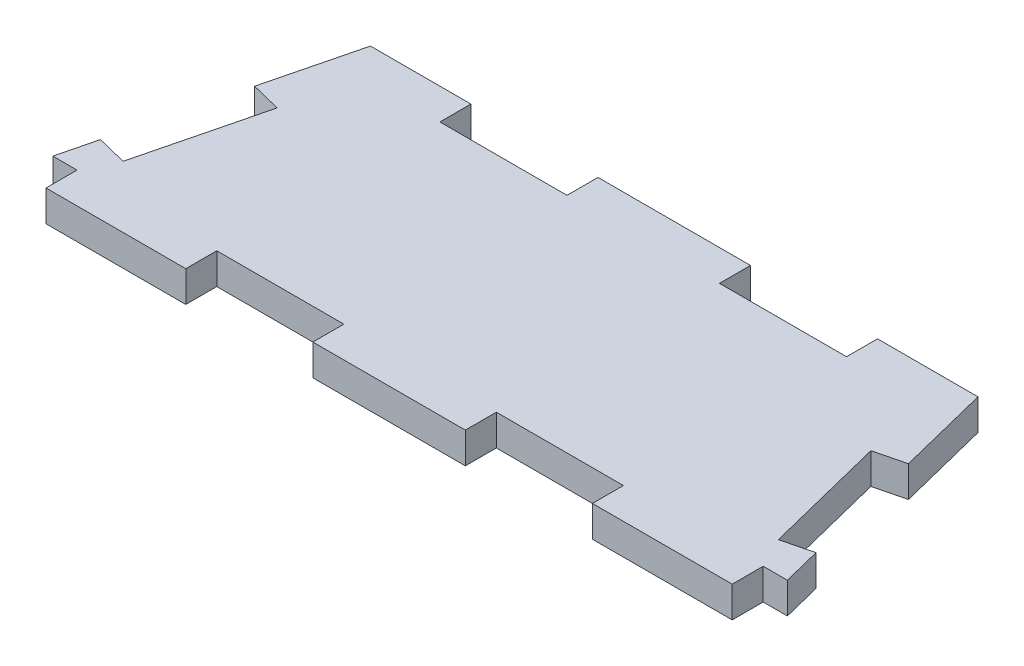
ISO-10303-21;
HEADER;
FILE_DESCRIPTION(('STEP AP214'),'2;1');
FILE_NAME('part.step','',(''),(''),'','','');
FILE_SCHEMA(('AUTOMOTIVE_DESIGN { 1 0 10303 214 1 1 1 1 }'));
ENDSEC;
DATA;
#1=APPLICATION_CONTEXT('core data for automotive mechanical design processes');
#2=APPLICATION_PROTOCOL_DEFINITION('international standard','automotive_design',2000,#1);
#3=PRODUCT_CONTEXT('',#1,'mechanical');
#4=PRODUCT('Part','Part','',(#3));
#5=PRODUCT_RELATED_PRODUCT_CATEGORY('part','',(#4));
#6=PRODUCT_DEFINITION_FORMATION('','',#4);
#7=PRODUCT_DEFINITION_CONTEXT('part definition',#1,'design');
#8=PRODUCT_DEFINITION('design','',#6,#7);
#9=PRODUCT_DEFINITION_SHAPE('','',#8);
#10=(LENGTH_UNIT() NAMED_UNIT(*) SI_UNIT(.MILLI.,.METRE.));
#11=(NAMED_UNIT(*) PLANE_ANGLE_UNIT() SI_UNIT($,.RADIAN.));
#12=(NAMED_UNIT(*) SI_UNIT($,.STERADIAN.) SOLID_ANGLE_UNIT());
#13=UNCERTAINTY_MEASURE_WITH_UNIT(LENGTH_MEASURE(1.E-05),#10,'distance_accuracy_value','');
#14=(GEOMETRIC_REPRESENTATION_CONTEXT(3) GLOBAL_UNCERTAINTY_ASSIGNED_CONTEXT((#13)) GLOBAL_UNIT_ASSIGNED_CONTEXT((#10,
#11,#12)) REPRESENTATION_CONTEXT('',''));
#15=CARTESIAN_POINT('',(0.,0.,0.));
#16=DIRECTION('',(0.,0.,1.));
#17=DIRECTION('',(1.,0.,0.));
#18=AXIS2_PLACEMENT_3D('',#15,#16,#17);
#19=CARTESIAN_POINT('',(-27.,2.44,0.));
#20=DIRECTION('',(1.,0.,0.));
#21=DIRECTION('',(0.,0.,-1.));
#22=AXIS2_PLACEMENT_3D('',#19,#20,#21);
#23=PLANE('',#22);
#24=DIRECTION('',(0.,0.,1.));
#25=VECTOR('',#24,1.);
#26=CARTESIAN_POINT('',(-27.,0.,0.));
#27=LINE('',#26,#25);
#28=CARTESIAN_POINT('',(-27.,0.,-2.44));
#29=VERTEX_POINT('',#28);
#30=CARTESIAN_POINT('',(-27.,0.,0.));
#31=VERTEX_POINT('',#30);
#32=EDGE_CURVE('E275',#29,#31,#27,.T.);
#33=ORIENTED_EDGE('',*,*,#32,.T.);
#34=DIRECTION('',(0.,-1.,0.));
#35=VECTOR('',#34,1.);
#36=CARTESIAN_POINT('',(-27.,2.44,0.));
#37=LINE('',#36,#35);
#38=CARTESIAN_POINT('',(-27.,2.44,0.));
#39=VERTEX_POINT('',#38);
#40=EDGE_CURVE('E11',#39,#31,#37,.T.);
#41=ORIENTED_EDGE('',*,*,#40,.F.);
#42=DIRECTION('',(0.,0.,1.));
#43=VECTOR('',#42,1.);
#44=CARTESIAN_POINT('',(-27.,2.44,0.));
#45=LINE('',#44,#43);
#46=CARTESIAN_POINT('',(-27.,2.44,-2.44));
#47=VERTEX_POINT('',#46);
#48=EDGE_CURVE('E337',#47,#39,#45,.T.);
#49=ORIENTED_EDGE('',*,*,#48,.F.);
#50=DIRECTION('',(0.,-1.,0.));
#51=VECTOR('',#50,1.);
#52=CARTESIAN_POINT('',(-27.,2.44,-2.44));
#53=LINE('',#52,#51);
#54=EDGE_CURVE('E271',#47,#29,#53,.T.);
#55=ORIENTED_EDGE('',*,*,#54,.T.);
#56=EDGE_LOOP('',(#33,#41,#49,#55));
#57=FACE_BOUND('',#56,.T.);
#58=ADVANCED_FACE('F35',(#57),#23,.F.);
#59=CARTESIAN_POINT('',(-27.,2.44,0.));
#60=DIRECTION('',(0.,0.,-1.));
#61=DIRECTION('',(-1.,0.,0.));
#62=AXIS2_PLACEMENT_3D('',#59,#60,#61);
#63=PLANE('',#62);
#64=DIRECTION('',(1.,0.,0.));
#65=VECTOR('',#64,1.);
#66=CARTESIAN_POINT('',(-27.,0.,0.));
#67=LINE('',#66,#65);
#68=CARTESIAN_POINT('',(-16.,0.,0.));
#69=VERTEX_POINT('',#68);
#70=EDGE_CURVE('E278',#31,#69,#67,.T.);
#71=ORIENTED_EDGE('',*,*,#70,.T.);
#72=DIRECTION('',(0.,-1.,0.));
#73=VECTOR('',#72,1.);
#74=CARTESIAN_POINT('',(-16.,2.44,0.));
#75=LINE('',#74,#73);
#76=CARTESIAN_POINT('',(-16.,2.44,0.));
#77=VERTEX_POINT('',#76);
#78=EDGE_CURVE('E43',#77,#69,#75,.T.);
#79=ORIENTED_EDGE('',*,*,#78,.F.);
#80=DIRECTION('',(1.,0.,0.));
#81=VECTOR('',#80,1.);
#82=CARTESIAN_POINT('',(-27.,2.44,0.));
#83=LINE('',#82,#81);
#84=EDGE_CURVE('E166',#39,#77,#83,.T.);
#85=ORIENTED_EDGE('',*,*,#84,.F.);
#86=ORIENTED_EDGE('',*,*,#40,.T.);
#87=EDGE_LOOP('',(#71,#79,#85,#86));
#88=FACE_BOUND('',#87,.T.);
#89=ADVANCED_FACE('F515',(#88),#63,.F.);
#90=CARTESIAN_POINT('',(-16.,2.44,0.));
#91=DIRECTION('',(-1.,0.,0.));
#92=DIRECTION('',(0.,0.,1.));
#93=AXIS2_PLACEMENT_3D('',#90,#91,#92);
#94=PLANE('',#93);
#95=DIRECTION('',(0.,0.,-1.));
#96=VECTOR('',#95,1.);
#97=CARTESIAN_POINT('',(-16.,0.,0.));
#98=LINE('',#97,#96);
#99=CARTESIAN_POINT('',(-16.,0.,-2.44));
#100=VERTEX_POINT('',#99);
#101=EDGE_CURVE('E280',#69,#100,#98,.T.);
#102=ORIENTED_EDGE('',*,*,#101,.T.);
#103=DIRECTION('',(0.,-1.,0.));
#104=VECTOR('',#103,1.);
#105=CARTESIAN_POINT('',(-16.,2.44,-2.44));
#106=LINE('',#105,#104);
#107=CARTESIAN_POINT('',(-16.,2.44,-2.44));
#108=VERTEX_POINT('',#107);
#109=EDGE_CURVE('E416',#108,#100,#106,.T.);
#110=ORIENTED_EDGE('',*,*,#109,.F.);
#111=DIRECTION('',(0.,0.,-1.));
#112=VECTOR('',#111,1.);
#113=CARTESIAN_POINT('',(-16.,2.44,0.));
#114=LINE('',#113,#112);
#115=EDGE_CURVE('E424',#77,#108,#114,.T.);
#116=ORIENTED_EDGE('',*,*,#115,.F.);
#117=ORIENTED_EDGE('',*,*,#78,.T.);
#118=EDGE_LOOP('',(#102,#110,#116,#117));
#119=FACE_BOUND('',#118,.T.);
#120=ADVANCED_FACE('F422',(#119),#94,.F.);
#121=CARTESIAN_POINT('',(-6.,2.44,-2.44));
#122=DIRECTION('',(0.,0.,-1.));
#123=DIRECTION('',(-1.,0.,0.));
#124=AXIS2_PLACEMENT_3D('',#121,#122,#123);
#125=PLANE('',#124);
#126=DIRECTION('',(1.,0.,0.));
#127=VECTOR('',#126,1.);
#128=CARTESIAN_POINT('',(-6.,0.,-2.44));
#129=LINE('',#128,#127);
#130=CARTESIAN_POINT('',(-6.,0.,-2.44));
#131=VERTEX_POINT('',#130);
#132=EDGE_CURVE('E282',#100,#131,#129,.T.);
#133=ORIENTED_EDGE('',*,*,#132,.T.);
#134=DIRECTION('',(0.,-1.,0.));
#135=VECTOR('',#134,1.);
#136=CARTESIAN_POINT('',(-6.,2.44,-2.44));
#137=LINE('',#136,#135);
#138=CARTESIAN_POINT('',(-6.,2.44,-2.44));
#139=VERTEX_POINT('',#138);
#140=EDGE_CURVE('E413',#139,#131,#137,.T.);
#141=ORIENTED_EDGE('',*,*,#140,.F.);
#142=DIRECTION('',(1.,0.,0.));
#143=VECTOR('',#142,1.);
#144=CARTESIAN_POINT('',(-6.,2.44,-2.44));
#145=LINE('',#144,#143);
#146=EDGE_CURVE('E442',#108,#139,#145,.T.);
#147=ORIENTED_EDGE('',*,*,#146,.F.);
#148=ORIENTED_EDGE('',*,*,#109,.T.);
#149=EDGE_LOOP('',(#133,#141,#147,#148));
#150=FACE_BOUND('',#149,.T.);
#151=ADVANCED_FACE('F433',(#150),#125,.F.);
#152=CARTESIAN_POINT('',(-6.,2.44,0.));
#153=DIRECTION('',(1.,0.,0.));
#154=DIRECTION('',(0.,0.,-1.));
#155=AXIS2_PLACEMENT_3D('',#152,#153,#154);
#156=PLANE('',#155);
#157=DIRECTION('',(0.,0.,1.));
#158=VECTOR('',#157,1.);
#159=CARTESIAN_POINT('',(-6.,0.,0.));
#160=LINE('',#159,#158);
#161=CARTESIAN_POINT('',(-6.,0.,0.));
#162=VERTEX_POINT('',#161);
#163=EDGE_CURVE('E284',#131,#162,#160,.T.);
#164=ORIENTED_EDGE('',*,*,#163,.T.);
#165=DIRECTION('',(0.,-1.,0.));
#166=VECTOR('',#165,1.);
#167=CARTESIAN_POINT('',(-6.,2.44,0.));
#168=LINE('',#167,#166);
#169=CARTESIAN_POINT('',(-6.,2.44,0.));
#170=VERTEX_POINT('',#169);
#171=EDGE_CURVE('E410',#170,#162,#168,.T.);
#172=ORIENTED_EDGE('',*,*,#171,.F.);
#173=DIRECTION('',(0.,0.,1.));
#174=VECTOR('',#173,1.);
#175=CARTESIAN_POINT('',(-6.,2.44,0.));
#176=LINE('',#175,#174);
#177=EDGE_CURVE('E439',#139,#170,#176,.T.);
#178=ORIENTED_EDGE('',*,*,#177,.F.);
#179=ORIENTED_EDGE('',*,*,#140,.T.);
#180=EDGE_LOOP('',(#164,#172,#178,#179));
#181=FACE_BOUND('',#180,.T.);
#182=ADVANCED_FACE('F437',(#181),#156,.F.);
#183=CARTESIAN_POINT('',(-6.,2.44,0.));
#184=DIRECTION('',(0.,0.,-1.));
#185=DIRECTION('',(-1.,0.,0.));
#186=AXIS2_PLACEMENT_3D('',#183,#184,#185);
#187=PLANE('',#186);
#188=DIRECTION('',(1.,0.,0.));
#189=VECTOR('',#188,1.);
#190=CARTESIAN_POINT('',(-6.,0.,0.));
#191=LINE('',#190,#189);
#192=CARTESIAN_POINT('',(6.,0.,0.));
#193=VERTEX_POINT('',#192);
#194=EDGE_CURVE('E286',#162,#193,#191,.T.);
#195=ORIENTED_EDGE('',*,*,#194,.T.);
#196=DIRECTION('',(0.,-1.,0.));
#197=VECTOR('',#196,1.);
#198=CARTESIAN_POINT('',(6.,2.44,0.));
#199=LINE('',#198,#197);
#200=CARTESIAN_POINT('',(6.,2.44,0.));
#201=VERTEX_POINT('',#200);
#202=EDGE_CURVE('E407',#201,#193,#199,.T.);
#203=ORIENTED_EDGE('',*,*,#202,.F.);
#204=DIRECTION('',(1.,0.,0.));
#205=VECTOR('',#204,1.);
#206=CARTESIAN_POINT('',(-6.,2.44,0.));
#207=LINE('',#206,#205);
#208=EDGE_CURVE('E441',#170,#201,#207,.T.);
#209=ORIENTED_EDGE('',*,*,#208,.F.);
#210=ORIENTED_EDGE('',*,*,#171,.T.);
#211=EDGE_LOOP('',(#195,#203,#209,#210));
#212=FACE_BOUND('',#211,.T.);
#213=ADVANCED_FACE('F528',(#212),#187,.F.);
#214=CARTESIAN_POINT('',(6.,2.44,0.));
#215=DIRECTION('',(-1.,0.,0.));
#216=DIRECTION('',(0.,0.,1.));
#217=AXIS2_PLACEMENT_3D('',#214,#215,#216);
#218=PLANE('',#217);
#219=DIRECTION('',(0.,0.,-1.));
#220=VECTOR('',#219,1.);
#221=CARTESIAN_POINT('',(6.,0.,0.));
#222=LINE('',#221,#220);
#223=CARTESIAN_POINT('',(6.,0.,-2.44));
#224=VERTEX_POINT('',#223);
#225=EDGE_CURVE('E288',#193,#224,#222,.T.);
#226=ORIENTED_EDGE('',*,*,#225,.T.);
#227=DIRECTION('',(0.,-1.,0.));
#228=VECTOR('',#227,1.);
#229=CARTESIAN_POINT('',(6.,2.44,-2.44));
#230=LINE('',#229,#228);
#231=CARTESIAN_POINT('',(6.,2.44,-2.44));
#232=VERTEX_POINT('',#231);
#233=EDGE_CURVE('E404',#232,#224,#230,.T.);
#234=ORIENTED_EDGE('',*,*,#233,.F.);
#235=DIRECTION('',(0.,0.,-1.));
#236=VECTOR('',#235,1.);
#237=CARTESIAN_POINT('',(6.,2.44,0.));
#238=LINE('',#237,#236);
#239=EDGE_CURVE('E444',#201,#232,#238,.T.);
#240=ORIENTED_EDGE('',*,*,#239,.F.);
#241=ORIENTED_EDGE('',*,*,#202,.T.);
#242=EDGE_LOOP('',(#226,#234,#240,#241));
#243=FACE_BOUND('',#242,.T.);
#244=ADVANCED_FACE('F531',(#243),#218,.F.);
#245=CARTESIAN_POINT('',(6.,2.44,-2.44));
#246=DIRECTION('',(0.,0.,-1.));
#247=DIRECTION('',(-1.,0.,0.));
#248=AXIS2_PLACEMENT_3D('',#245,#246,#247);
#249=PLANE('',#248);
#250=DIRECTION('',(1.,0.,0.));
#251=VECTOR('',#250,1.);
#252=CARTESIAN_POINT('',(6.,0.,-2.44));
#253=LINE('',#252,#251);
#254=CARTESIAN_POINT('',(16.,0.,-2.44));
#255=VERTEX_POINT('',#254);
#256=EDGE_CURVE('E290',#224,#255,#253,.T.);
#257=ORIENTED_EDGE('',*,*,#256,.T.);
#258=DIRECTION('',(0.,-1.,0.));
#259=VECTOR('',#258,1.);
#260=CARTESIAN_POINT('',(16.,2.44,-2.44));
#261=LINE('',#260,#259);
#262=CARTESIAN_POINT('',(16.,2.44,-2.44));
#263=VERTEX_POINT('',#262);
#264=EDGE_CURVE('E401',#263,#255,#261,.T.);
#265=ORIENTED_EDGE('',*,*,#264,.F.);
#266=DIRECTION('',(1.,0.,0.));
#267=VECTOR('',#266,1.);
#268=CARTESIAN_POINT('',(6.,2.44,-2.44));
#269=LINE('',#268,#267);
#270=EDGE_CURVE('E450',#232,#263,#269,.T.);
#271=ORIENTED_EDGE('',*,*,#270,.F.);
#272=ORIENTED_EDGE('',*,*,#233,.T.);
#273=EDGE_LOOP('',(#257,#265,#271,#272));
#274=FACE_BOUND('',#273,.T.);
#275=ADVANCED_FACE('F535',(#274),#249,.F.);
#276=CARTESIAN_POINT('',(16.,2.44,0.));
#277=DIRECTION('',(1.,0.,0.));
#278=DIRECTION('',(0.,0.,-1.));
#279=AXIS2_PLACEMENT_3D('',#276,#277,#278);
#280=PLANE('',#279);
#281=DIRECTION('',(0.,0.,1.));
#282=VECTOR('',#281,1.);
#283=CARTESIAN_POINT('',(16.,0.,0.));
#284=LINE('',#283,#282);
#285=CARTESIAN_POINT('',(16.,0.,0.));
#286=VERTEX_POINT('',#285);
#287=EDGE_CURVE('E292',#255,#286,#284,.T.);
#288=ORIENTED_EDGE('',*,*,#287,.T.);
#289=DIRECTION('',(0.,-1.,0.));
#290=VECTOR('',#289,1.);
#291=CARTESIAN_POINT('',(16.,2.44,0.));
#292=LINE('',#291,#290);
#293=CARTESIAN_POINT('',(16.,2.44,0.));
#294=VERTEX_POINT('',#293);
#295=EDGE_CURVE('E398',#294,#286,#292,.T.);
#296=ORIENTED_EDGE('',*,*,#295,.F.);
#297=DIRECTION('',(0.,0.,1.));
#298=VECTOR('',#297,1.);
#299=CARTESIAN_POINT('',(16.,2.44,0.));
#300=LINE('',#299,#298);
#301=EDGE_CURVE('E452',#263,#294,#300,.T.);
#302=ORIENTED_EDGE('',*,*,#301,.F.);
#303=ORIENTED_EDGE('',*,*,#264,.T.);
#304=EDGE_LOOP('',(#288,#296,#302,#303));
#305=FACE_BOUND('',#304,.T.);
#306=ADVANCED_FACE('F539',(#305),#280,.F.);
#307=CARTESIAN_POINT('',(16.,2.44,0.));
#308=DIRECTION('',(0.,0.,-1.));
#309=DIRECTION('',(-1.,0.,0.));
#310=AXIS2_PLACEMENT_3D('',#307,#308,#309);
#311=PLANE('',#310);
#312=DIRECTION('',(1.,0.,0.));
#313=VECTOR('',#312,1.);
#314=CARTESIAN_POINT('',(16.,0.,0.));
#315=LINE('',#314,#313);
#316=CARTESIAN_POINT('',(27.,0.,0.));
#317=VERTEX_POINT('',#316);
#318=EDGE_CURVE('E294',#286,#317,#315,.T.);
#319=ORIENTED_EDGE('',*,*,#318,.T.);
#320=DIRECTION('',(0.,-1.,0.));
#321=VECTOR('',#320,1.);
#322=CARTESIAN_POINT('',(27.,2.44,0.));
#323=LINE('',#322,#321);
#324=CARTESIAN_POINT('',(27.,2.44,0.));
#325=VERTEX_POINT('',#324);
#326=EDGE_CURVE('E395',#325,#317,#323,.T.);
#327=ORIENTED_EDGE('',*,*,#326,.F.);
#328=DIRECTION('',(1.,0.,0.));
#329=VECTOR('',#328,1.);
#330=CARTESIAN_POINT('',(16.,2.44,0.));
#331=LINE('',#330,#329);
#332=EDGE_CURVE('E454',#294,#325,#331,.T.);
#333=ORIENTED_EDGE('',*,*,#332,.F.);
#334=ORIENTED_EDGE('',*,*,#295,.T.);
#335=EDGE_LOOP('',(#319,#327,#333,#334));
#336=FACE_BOUND('',#335,.T.);
#337=ADVANCED_FACE('F543',(#336),#311,.F.);
#338=CARTESIAN_POINT('',(27.,2.44,0.));
#339=DIRECTION('',(-1.,0.,0.));
#340=DIRECTION('',(0.,0.,1.));
#341=AXIS2_PLACEMENT_3D('',#338,#339,#340);
#342=PLANE('',#341);
#343=DIRECTION('',(0.,0.,-1.));
#344=VECTOR('',#343,1.);
#345=CARTESIAN_POINT('',(27.,0.,0.));
#346=LINE('',#345,#344);
#347=CARTESIAN_POINT('',(27.,0.,-2.44));
#348=VERTEX_POINT('',#347);
#349=EDGE_CURVE('E296',#317,#348,#346,.T.);
#350=ORIENTED_EDGE('',*,*,#349,.T.);
#351=DIRECTION('',(0.,-1.,0.));
#352=VECTOR('',#351,1.);
#353=CARTESIAN_POINT('',(27.,2.44,-2.44));
#354=LINE('',#353,#352);
#355=CARTESIAN_POINT('',(27.,2.44,-2.44));
#356=VERTEX_POINT('',#355);
#357=EDGE_CURVE('E392',#356,#348,#354,.T.);
#358=ORIENTED_EDGE('',*,*,#357,.F.);
#359=DIRECTION('',(0.,0.,-1.));
#360=VECTOR('',#359,1.);
#361=CARTESIAN_POINT('',(27.,2.44,0.));
#362=LINE('',#361,#360);
#363=EDGE_CURVE('E456',#325,#356,#362,.T.);
#364=ORIENTED_EDGE('',*,*,#363,.F.);
#365=ORIENTED_EDGE('',*,*,#326,.T.);
#366=EDGE_LOOP('',(#350,#358,#364,#365));
#367=FACE_BOUND('',#366,.T.);
#368=ADVANCED_FACE('F547',(#367),#342,.F.);
#369=CARTESIAN_POINT('',(27.,2.44,-2.44));
#370=DIRECTION('',(0.,0.,-1.));
#371=DIRECTION('',(-1.,0.,0.));
#372=AXIS2_PLACEMENT_3D('',#369,#370,#371);
#373=PLANE('',#372);
#374=DIRECTION('',(1.,0.,0.));
#375=VECTOR('',#374,1.);
#376=CARTESIAN_POINT('',(27.,0.,-2.44));
#377=LINE('',#376,#375);
#378=CARTESIAN_POINT('',(28.9050944316268,0.,-2.44));
#379=VERTEX_POINT('',#378);
#380=EDGE_CURVE('E298',#348,#379,#377,.T.);
#381=ORIENTED_EDGE('',*,*,#380,.T.);
#382=DIRECTION('',(0.,-1.,0.));
#383=VECTOR('',#382,1.);
#384=CARTESIAN_POINT('',(28.9050944316268,2.44,-2.44));
#385=LINE('',#384,#383);
#386=CARTESIAN_POINT('',(28.9050944316268,2.44,-2.44));
#387=VERTEX_POINT('',#386);
#388=EDGE_CURVE('E389',#387,#379,#385,.T.);
#389=ORIENTED_EDGE('',*,*,#388,.F.);
#390=DIRECTION('',(1.,0.,0.));
#391=VECTOR('',#390,1.);
#392=CARTESIAN_POINT('',(27.,2.44,-2.44));
#393=LINE('',#392,#391);
#394=EDGE_CURVE('E458',#356,#387,#393,.T.);
#395=ORIENTED_EDGE('',*,*,#394,.F.);
#396=ORIENTED_EDGE('',*,*,#357,.T.);
#397=EDGE_LOOP('',(#381,#389,#395,#396));
#398=FACE_BOUND('',#397,.T.);
#399=ADVANCED_FACE('F551',(#398),#373,.F.);
#400=CARTESIAN_POINT('',(28.9050944316268,2.44,-2.44));
#401=DIRECTION('',(-0.970142500145331,0.,0.242535625036336));
#402=DIRECTION('',(0.242535625036336,0.,0.970142500145331));
#403=AXIS2_PLACEMENT_3D('',#400,#401,#402);
#404=PLANE('',#403);
#405=DIRECTION('',(-0.242535625036336,0.,-0.970142500145331));
#406=VECTOR('',#405,1.);
#407=CARTESIAN_POINT('',(28.9050944316268,0.,-2.44));
#408=LINE('',#407,#406);
#409=CARTESIAN_POINT('',(28.1544695751729,0.,-5.44249942581531));
#410=VERTEX_POINT('',#409);
#411=EDGE_CURVE('E300',#379,#410,#408,.T.);
#412=ORIENTED_EDGE('',*,*,#411,.T.);
#413=DIRECTION('',(0.,-1.,0.));
#414=VECTOR('',#413,1.);
#415=CARTESIAN_POINT('',(28.1544695751729,2.44,-5.44249942581531));
#416=LINE('',#415,#414);
#417=CARTESIAN_POINT('',(28.1544695751729,2.44,-5.44249942581531));
#418=VERTEX_POINT('',#417);
#419=EDGE_CURVE('E386',#418,#410,#416,.T.);
#420=ORIENTED_EDGE('',*,*,#419,.F.);
#421=DIRECTION('',(-0.242535625036336,0.,-0.970142500145331));
#422=VECTOR('',#421,1.);
#423=CARTESIAN_POINT('',(28.9050944316268,2.44,-2.44));
#424=LINE('',#423,#422);
#425=EDGE_CURVE('E460',#387,#418,#424,.T.);
#426=ORIENTED_EDGE('',*,*,#425,.F.);
#427=ORIENTED_EDGE('',*,*,#388,.T.);
#428=EDGE_LOOP('',(#412,#420,#426,#427));
#429=FACE_BOUND('',#428,.T.);
#430=ADVANCED_FACE('F555',(#429),#404,.F.);
#431=CARTESIAN_POINT('',(25.7873218748183,2.44,-4.85071250072666));
#432=DIRECTION('',(0.242535625036333,0.,0.970142500145332));
#433=DIRECTION('',(0.970142500145332,0.,-0.242535625036333));
#434=AXIS2_PLACEMENT_3D('',#431,#432,#433);
#435=PLANE('',#434);
#436=DIRECTION('',(-0.970142500145332,0.,0.242535625036333));
#437=VECTOR('',#436,1.);
#438=CARTESIAN_POINT('',(25.7873218748183,0.,-4.85071250072666));
#439=LINE('',#438,#437);
#440=CARTESIAN_POINT('',(25.7873218748183,0.,-4.85071250072666));
#441=VERTEX_POINT('',#440);
#442=EDGE_CURVE('E302',#410,#441,#439,.T.);
#443=ORIENTED_EDGE('',*,*,#442,.T.);
#444=DIRECTION('',(0.,-1.,0.));
#445=VECTOR('',#444,1.);
#446=CARTESIAN_POINT('',(25.7873218748183,2.44,-4.85071250072666));
#447=LINE('',#446,#445);
#448=CARTESIAN_POINT('',(25.7873218748183,2.44,-4.85071250072666));
#449=VERTEX_POINT('',#448);
#450=EDGE_CURVE('E383',#449,#441,#447,.T.);
#451=ORIENTED_EDGE('',*,*,#450,.F.);
#452=DIRECTION('',(-0.970142500145332,0.,0.242535625036333));
#453=VECTOR('',#452,1.);
#454=CARTESIAN_POINT('',(25.7873218748183,2.44,-4.85071250072666));
#455=LINE('',#454,#453);
#456=EDGE_CURVE('E462',#418,#449,#455,.T.);
#457=ORIENTED_EDGE('',*,*,#456,.F.);
#458=ORIENTED_EDGE('',*,*,#419,.T.);
#459=EDGE_LOOP('',(#443,#451,#457,#458));
#460=FACE_BOUND('',#459,.T.);
#461=ADVANCED_FACE('F559',(#460),#435,.F.);
#462=CARTESIAN_POINT('',(25.7873218748183,2.44,-4.85071250072666));
#463=DIRECTION('',(-0.970142500145332,0.,0.242535625036334));
#464=DIRECTION('',(0.242535625036334,0.,0.970142500145332));
#465=AXIS2_PLACEMENT_3D('',#462,#463,#464);
#466=PLANE('',#465);
#467=DIRECTION('',(-0.242535625036334,0.,-0.970142500145332));
#468=VECTOR('',#467,1.);
#469=CARTESIAN_POINT('',(25.7873218748183,0.,-4.85071250072666));
#470=LINE('',#469,#468);
#471=CARTESIAN_POINT('',(23.361965624455,0.,-14.55213750218));
#472=VERTEX_POINT('',#471);
#473=EDGE_CURVE('E304',#441,#472,#470,.T.);
#474=ORIENTED_EDGE('',*,*,#473,.T.);
#475=DIRECTION('',(0.,-1.,0.));
#476=VECTOR('',#475,1.);
#477=CARTESIAN_POINT('',(23.361965624455,2.44,-14.55213750218));
#478=LINE('',#477,#476);
#479=CARTESIAN_POINT('',(23.361965624455,2.44,-14.55213750218));
#480=VERTEX_POINT('',#479);
#481=EDGE_CURVE('E380',#480,#472,#478,.T.);
#482=ORIENTED_EDGE('',*,*,#481,.F.);
#483=DIRECTION('',(-0.242535625036334,0.,-0.970142500145332));
#484=VECTOR('',#483,1.);
#485=CARTESIAN_POINT('',(25.7873218748183,2.44,-4.85071250072666));
#486=LINE('',#485,#484);
#487=EDGE_CURVE('E464',#449,#480,#486,.T.);
#488=ORIENTED_EDGE('',*,*,#487,.F.);
#489=ORIENTED_EDGE('',*,*,#450,.T.);
#490=EDGE_LOOP('',(#474,#482,#488,#489));
#491=FACE_BOUND('',#490,.T.);
#492=ADVANCED_FACE('F563',(#491),#466,.F.);
#493=CARTESIAN_POINT('',(23.361965624455,2.44,-14.55213750218));
#494=DIRECTION('',(-0.242535625036335,0.,-0.970142500145331));
#495=DIRECTION('',(-0.970142500145332,0.,0.242535625036335));
#496=AXIS2_PLACEMENT_3D('',#493,#494,#495);
#497=PLANE('',#496);
#498=DIRECTION('',(0.970142500145332,0.,-0.242535625036335));
#499=VECTOR('',#498,1.);
#500=CARTESIAN_POINT('',(23.361965624455,0.,-14.55213750218));
#501=LINE('',#500,#499);
#502=CARTESIAN_POINT('',(25.7291133248096,0.,-15.1439244272686));
#503=VERTEX_POINT('',#502);
#504=EDGE_CURVE('E306',#472,#503,#501,.T.);
#505=ORIENTED_EDGE('',*,*,#504,.T.);
#506=DIRECTION('',(0.,-1.,0.));
#507=VECTOR('',#506,1.);
#508=CARTESIAN_POINT('',(25.7291133248096,2.44,-15.1439244272686));
#509=LINE('',#508,#507);
#510=CARTESIAN_POINT('',(25.7291133248096,2.44,-15.1439244272686));
#511=VERTEX_POINT('',#510);
#512=EDGE_CURVE('E377',#511,#503,#509,.T.);
#513=ORIENTED_EDGE('',*,*,#512,.F.);
#514=DIRECTION('',(0.970142500145332,0.,-0.242535625036335));
#515=VECTOR('',#514,1.);
#516=CARTESIAN_POINT('',(23.361965624455,2.44,-14.55213750218));
#517=LINE('',#516,#515);
#518=EDGE_CURVE('E466',#480,#511,#517,.T.);
#519=ORIENTED_EDGE('',*,*,#518,.F.);
#520=ORIENTED_EDGE('',*,*,#481,.T.);
#521=EDGE_LOOP('',(#505,#513,#519,#520));
#522=FACE_BOUND('',#521,.T.);
#523=ADVANCED_FACE('F567',(#522),#497,.F.);
#524=CARTESIAN_POINT('',(25.7291133248096,2.44,-15.1439244272686));
#525=DIRECTION('',(-0.970142500145332,0.,0.242535625036331));
#526=DIRECTION('',(0.242535625036331,0.,0.970142500145332));
#527=AXIS2_PLACEMENT_3D('',#524,#525,#526);
#528=PLANE('',#527);
#529=DIRECTION('',(-0.242535625036331,0.,-0.970142500145332));
#530=VECTOR('',#529,1.);
#531=CARTESIAN_POINT('',(25.7291133248096,0.,-15.1439244272686));
#532=LINE('',#531,#530);
#533=CARTESIAN_POINT('',(23.9050944316268,0.,-22.44));
#534=VERTEX_POINT('',#533);
#535=EDGE_CURVE('E308',#503,#534,#532,.T.);
#536=ORIENTED_EDGE('',*,*,#535,.T.);
#537=DIRECTION('',(0.,-1.,0.));
#538=VECTOR('',#537,1.);
#539=CARTESIAN_POINT('',(23.9050944316268,2.44,-22.44));
#540=LINE('',#539,#538);
#541=CARTESIAN_POINT('',(23.9050944316268,2.44,-22.44));
#542=VERTEX_POINT('',#541);
#543=EDGE_CURVE('E374',#542,#534,#540,.T.);
#544=ORIENTED_EDGE('',*,*,#543,.F.);
#545=DIRECTION('',(-0.242535625036331,0.,-0.970142500145332));
#546=VECTOR('',#545,1.);
#547=CARTESIAN_POINT('',(25.7291133248096,2.44,-15.1439244272686));
#548=LINE('',#547,#546);
#549=EDGE_CURVE('E468',#511,#542,#548,.T.);
#550=ORIENTED_EDGE('',*,*,#549,.F.);
#551=ORIENTED_EDGE('',*,*,#512,.T.);
#552=EDGE_LOOP('',(#536,#544,#550,#551));
#553=FACE_BOUND('',#552,.T.);
#554=ADVANCED_FACE('F571',(#553),#528,.F.);
#555=CARTESIAN_POINT('',(16.,2.44,-22.44));
#556=DIRECTION('',(0.,0.,1.));
#557=DIRECTION('',(1.,0.,0.));
#558=AXIS2_PLACEMENT_3D('',#555,#556,#557);
#559=PLANE('',#558);
#560=DIRECTION('',(-1.,0.,0.));
#561=VECTOR('',#560,1.);
#562=CARTESIAN_POINT('',(16.,0.,-22.44));
#563=LINE('',#562,#561);
#564=CARTESIAN_POINT('',(16.,0.,-22.44));
#565=VERTEX_POINT('',#564);
#566=EDGE_CURVE('E310',#534,#565,#563,.T.);
#567=ORIENTED_EDGE('',*,*,#566,.T.);
#568=DIRECTION('',(0.,-1.,0.));
#569=VECTOR('',#568,1.);
#570=CARTESIAN_POINT('',(16.,2.44,-22.44));
#571=LINE('',#570,#569);
#572=CARTESIAN_POINT('',(16.,2.44,-22.44));
#573=VERTEX_POINT('',#572);
#574=EDGE_CURVE('E371',#573,#565,#571,.T.);
#575=ORIENTED_EDGE('',*,*,#574,.F.);
#576=DIRECTION('',(-1.,0.,0.));
#577=VECTOR('',#576,1.);
#578=CARTESIAN_POINT('',(16.,2.44,-22.44));
#579=LINE('',#578,#577);
#580=EDGE_CURVE('E470',#542,#573,#579,.T.);
#581=ORIENTED_EDGE('',*,*,#580,.F.);
#582=ORIENTED_EDGE('',*,*,#543,.T.);
#583=EDGE_LOOP('',(#567,#575,#581,#582));
#584=FACE_BOUND('',#583,.T.);
#585=ADVANCED_FACE('F575',(#584),#559,.F.);
#586=CARTESIAN_POINT('',(16.,2.44,-22.44));
#587=DIRECTION('',(1.,0.,0.));
#588=DIRECTION('',(0.,0.,-1.));
#589=AXIS2_PLACEMENT_3D('',#586,#587,#588);
#590=PLANE('',#589);
#591=DIRECTION('',(0.,0.,1.));
#592=VECTOR('',#591,1.);
#593=CARTESIAN_POINT('',(16.,0.,-22.44));
#594=LINE('',#593,#592);
#595=CARTESIAN_POINT('',(16.,0.,-20.));
#596=VERTEX_POINT('',#595);
#597=EDGE_CURVE('E312',#565,#596,#594,.T.);
#598=ORIENTED_EDGE('',*,*,#597,.T.);
#599=DIRECTION('',(0.,-1.,0.));
#600=VECTOR('',#599,1.);
#601=CARTESIAN_POINT('',(16.,2.44,-20.));
#602=LINE('',#601,#600);
#603=CARTESIAN_POINT('',(16.,2.44,-20.));
#604=VERTEX_POINT('',#603);
#605=EDGE_CURVE('E368',#604,#596,#602,.T.);
#606=ORIENTED_EDGE('',*,*,#605,.F.);
#607=DIRECTION('',(0.,0.,1.));
#608=VECTOR('',#607,1.);
#609=CARTESIAN_POINT('',(16.,2.44,-22.44));
#610=LINE('',#609,#608);
#611=EDGE_CURVE('E472',#573,#604,#610,.T.);
#612=ORIENTED_EDGE('',*,*,#611,.F.);
#613=ORIENTED_EDGE('',*,*,#574,.T.);
#614=EDGE_LOOP('',(#598,#606,#612,#613));
#615=FACE_BOUND('',#614,.T.);
#616=ADVANCED_FACE('F579',(#615),#590,.F.);
#617=CARTESIAN_POINT('',(6.,2.44,-20.));
#618=DIRECTION('',(0.,0.,1.));
#619=DIRECTION('',(1.,0.,0.));
#620=AXIS2_PLACEMENT_3D('',#617,#618,#619);
#621=PLANE('',#620);
#622=DIRECTION('',(-1.,0.,0.));
#623=VECTOR('',#622,1.);
#624=CARTESIAN_POINT('',(6.,0.,-20.));
#625=LINE('',#624,#623);
#626=CARTESIAN_POINT('',(6.,0.,-20.));
#627=VERTEX_POINT('',#626);
#628=EDGE_CURVE('E314',#596,#627,#625,.T.);
#629=ORIENTED_EDGE('',*,*,#628,.T.);
#630=DIRECTION('',(0.,-1.,0.));
#631=VECTOR('',#630,1.);
#632=CARTESIAN_POINT('',(6.,2.44,-20.));
#633=LINE('',#632,#631);
#634=CARTESIAN_POINT('',(6.,2.44,-20.));
#635=VERTEX_POINT('',#634);
#636=EDGE_CURVE('E365',#635,#627,#633,.T.);
#637=ORIENTED_EDGE('',*,*,#636,.F.);
#638=DIRECTION('',(-1.,0.,0.));
#639=VECTOR('',#638,1.);
#640=CARTESIAN_POINT('',(6.,2.44,-20.));
#641=LINE('',#640,#639);
#642=EDGE_CURVE('E474',#604,#635,#641,.T.);
#643=ORIENTED_EDGE('',*,*,#642,.F.);
#644=ORIENTED_EDGE('',*,*,#605,.T.);
#645=EDGE_LOOP('',(#629,#637,#643,#644));
#646=FACE_BOUND('',#645,.T.);
#647=ADVANCED_FACE('F583',(#646),#621,.F.);
#648=CARTESIAN_POINT('',(6.,2.44,-22.44));
#649=DIRECTION('',(-1.,0.,0.));
#650=DIRECTION('',(0.,0.,1.));
#651=AXIS2_PLACEMENT_3D('',#648,#649,#650);
#652=PLANE('',#651);
#653=DIRECTION('',(0.,0.,-1.));
#654=VECTOR('',#653,1.);
#655=CARTESIAN_POINT('',(6.,0.,-22.44));
#656=LINE('',#655,#654);
#657=CARTESIAN_POINT('',(6.,0.,-22.44));
#658=VERTEX_POINT('',#657);
#659=EDGE_CURVE('E316',#627,#658,#656,.T.);
#660=ORIENTED_EDGE('',*,*,#659,.T.);
#661=DIRECTION('',(0.,-1.,0.));
#662=VECTOR('',#661,1.);
#663=CARTESIAN_POINT('',(6.,2.44,-22.44));
#664=LINE('',#663,#662);
#665=CARTESIAN_POINT('',(6.,2.44,-22.44));
#666=VERTEX_POINT('',#665);
#667=EDGE_CURVE('E362',#666,#658,#664,.T.);
#668=ORIENTED_EDGE('',*,*,#667,.F.);
#669=DIRECTION('',(0.,0.,-1.));
#670=VECTOR('',#669,1.);
#671=CARTESIAN_POINT('',(6.,2.44,-22.44));
#672=LINE('',#671,#670);
#673=EDGE_CURVE('E476',#635,#666,#672,.T.);
#674=ORIENTED_EDGE('',*,*,#673,.F.);
#675=ORIENTED_EDGE('',*,*,#636,.T.);
#676=EDGE_LOOP('',(#660,#668,#674,#675));
#677=FACE_BOUND('',#676,.T.);
#678=ADVANCED_FACE('F587',(#677),#652,.F.);
#679=CARTESIAN_POINT('',(-6.,2.44,-22.44));
#680=DIRECTION('',(0.,0.,1.));
#681=DIRECTION('',(1.,0.,0.));
#682=AXIS2_PLACEMENT_3D('',#679,#680,#681);
#683=PLANE('',#682);
#684=DIRECTION('',(-1.,0.,0.));
#685=VECTOR('',#684,1.);
#686=CARTESIAN_POINT('',(-6.,0.,-22.44));
#687=LINE('',#686,#685);
#688=CARTESIAN_POINT('',(-6.,0.,-22.44));
#689=VERTEX_POINT('',#688);
#690=EDGE_CURVE('E318',#658,#689,#687,.T.);
#691=ORIENTED_EDGE('',*,*,#690,.T.);
#692=DIRECTION('',(0.,-1.,0.));
#693=VECTOR('',#692,1.);
#694=CARTESIAN_POINT('',(-6.,2.44,-22.44));
#695=LINE('',#694,#693);
#696=CARTESIAN_POINT('',(-6.,2.44,-22.44));
#697=VERTEX_POINT('',#696);
#698=EDGE_CURVE('E359',#697,#689,#695,.T.);
#699=ORIENTED_EDGE('',*,*,#698,.F.);
#700=DIRECTION('',(-1.,0.,0.));
#701=VECTOR('',#700,1.);
#702=CARTESIAN_POINT('',(-6.,2.44,-22.44));
#703=LINE('',#702,#701);
#704=EDGE_CURVE('E478',#666,#697,#703,.T.);
#705=ORIENTED_EDGE('',*,*,#704,.F.);
#706=ORIENTED_EDGE('',*,*,#667,.T.);
#707=EDGE_LOOP('',(#691,#699,#705,#706));
#708=FACE_BOUND('',#707,.T.);
#709=ADVANCED_FACE('F591',(#708),#683,.F.);
#710=CARTESIAN_POINT('',(-6.,2.44,-22.44));
#711=DIRECTION('',(1.,0.,0.));
#712=DIRECTION('',(0.,0.,-1.));
#713=AXIS2_PLACEMENT_3D('',#710,#711,#712);
#714=PLANE('',#713);
#715=DIRECTION('',(0.,0.,1.));
#716=VECTOR('',#715,1.);
#717=CARTESIAN_POINT('',(-6.,0.,-22.44));
#718=LINE('',#717,#716);
#719=CARTESIAN_POINT('',(-6.,0.,-20.));
#720=VERTEX_POINT('',#719);
#721=EDGE_CURVE('E320',#689,#720,#718,.T.);
#722=ORIENTED_EDGE('',*,*,#721,.T.);
#723=DIRECTION('',(0.,-1.,0.));
#724=VECTOR('',#723,1.);
#725=CARTESIAN_POINT('',(-6.,2.44,-20.));
#726=LINE('',#725,#724);
#727=CARTESIAN_POINT('',(-6.,2.44,-20.));
#728=VERTEX_POINT('',#727);
#729=EDGE_CURVE('E356',#728,#720,#726,.T.);
#730=ORIENTED_EDGE('',*,*,#729,.F.);
#731=DIRECTION('',(0.,0.,1.));
#732=VECTOR('',#731,1.);
#733=CARTESIAN_POINT('',(-6.,2.44,-22.44));
#734=LINE('',#733,#732);
#735=EDGE_CURVE('E480',#697,#728,#734,.T.);
#736=ORIENTED_EDGE('',*,*,#735,.F.);
#737=ORIENTED_EDGE('',*,*,#698,.T.);
#738=EDGE_LOOP('',(#722,#730,#736,#737));
#739=FACE_BOUND('',#738,.T.);
#740=ADVANCED_FACE('F595',(#739),#714,.F.);
#741=CARTESIAN_POINT('',(-16.,2.44,-20.));
#742=DIRECTION('',(0.,0.,1.));
#743=DIRECTION('',(1.,0.,0.));
#744=AXIS2_PLACEMENT_3D('',#741,#742,#743);
#745=PLANE('',#744);
#746=DIRECTION('',(-1.,0.,0.));
#747=VECTOR('',#746,1.);
#748=CARTESIAN_POINT('',(-16.,0.,-20.));
#749=LINE('',#748,#747);
#750=CARTESIAN_POINT('',(-16.,0.,-20.));
#751=VERTEX_POINT('',#750);
#752=EDGE_CURVE('E322',#720,#751,#749,.T.);
#753=ORIENTED_EDGE('',*,*,#752,.T.);
#754=DIRECTION('',(0.,-1.,0.));
#755=VECTOR('',#754,1.);
#756=CARTESIAN_POINT('',(-16.,2.44,-20.));
#757=LINE('',#756,#755);
#758=CARTESIAN_POINT('',(-16.,2.44,-20.));
#759=VERTEX_POINT('',#758);
#760=EDGE_CURVE('E353',#759,#751,#757,.T.);
#761=ORIENTED_EDGE('',*,*,#760,.F.);
#762=DIRECTION('',(-1.,0.,0.));
#763=VECTOR('',#762,1.);
#764=CARTESIAN_POINT('',(-16.,2.44,-20.));
#765=LINE('',#764,#763);
#766=EDGE_CURVE('E482',#728,#759,#765,.T.);
#767=ORIENTED_EDGE('',*,*,#766,.F.);
#768=ORIENTED_EDGE('',*,*,#729,.T.);
#769=EDGE_LOOP('',(#753,#761,#767,#768));
#770=FACE_BOUND('',#769,.T.);
#771=ADVANCED_FACE('F599',(#770),#745,.F.);
#772=CARTESIAN_POINT('',(-16.,2.44,-22.44));
#773=DIRECTION('',(-1.,0.,0.));
#774=DIRECTION('',(0.,0.,1.));
#775=AXIS2_PLACEMENT_3D('',#772,#773,#774);
#776=PLANE('',#775);
#777=DIRECTION('',(0.,0.,-1.));
#778=VECTOR('',#777,1.);
#779=CARTESIAN_POINT('',(-16.,0.,-22.44));
#780=LINE('',#779,#778);
#781=CARTESIAN_POINT('',(-16.,0.,-22.44));
#782=VERTEX_POINT('',#781);
#783=EDGE_CURVE('E324',#751,#782,#780,.T.);
#784=ORIENTED_EDGE('',*,*,#783,.T.);
#785=DIRECTION('',(0.,-1.,0.));
#786=VECTOR('',#785,1.);
#787=CARTESIAN_POINT('',(-16.,2.44,-22.44));
#788=LINE('',#787,#786);
#789=CARTESIAN_POINT('',(-16.,2.44,-22.44));
#790=VERTEX_POINT('',#789);
#791=EDGE_CURVE('E350',#790,#782,#788,.T.);
#792=ORIENTED_EDGE('',*,*,#791,.F.);
#793=DIRECTION('',(0.,0.,-1.));
#794=VECTOR('',#793,1.);
#795=CARTESIAN_POINT('',(-16.,2.44,-22.44));
#796=LINE('',#795,#794);
#797=EDGE_CURVE('E484',#759,#790,#796,.T.);
#798=ORIENTED_EDGE('',*,*,#797,.F.);
#799=ORIENTED_EDGE('',*,*,#760,.T.);
#800=EDGE_LOOP('',(#784,#792,#798,#799));
#801=FACE_BOUND('',#800,.T.);
#802=ADVANCED_FACE('F603',(#801),#776,.F.);
#803=CARTESIAN_POINT('',(-23.9050944316268,2.44,-22.44));
#804=DIRECTION('',(0.,0.,1.));
#805=DIRECTION('',(1.,0.,0.));
#806=AXIS2_PLACEMENT_3D('',#803,#804,#805);
#807=PLANE('',#806);
#808=DIRECTION('',(-1.,0.,0.));
#809=VECTOR('',#808,1.);
#810=CARTESIAN_POINT('',(-23.9050944316268,0.,-22.44));
#811=LINE('',#810,#809);
#812=CARTESIAN_POINT('',(-23.9050944316268,0.,-22.44));
#813=VERTEX_POINT('',#812);
#814=EDGE_CURVE('E326',#782,#813,#811,.T.);
#815=ORIENTED_EDGE('',*,*,#814,.T.);
#816=DIRECTION('',(0.,-1.,0.));
#817=VECTOR('',#816,1.);
#818=CARTESIAN_POINT('',(-23.9050944316268,2.44,-22.44));
#819=LINE('',#818,#817);
#820=CARTESIAN_POINT('',(-23.9050944316268,2.44,-22.44));
#821=VERTEX_POINT('',#820);
#822=EDGE_CURVE('E347',#821,#813,#819,.T.);
#823=ORIENTED_EDGE('',*,*,#822,.F.);
#824=DIRECTION('',(-1.,0.,0.));
#825=VECTOR('',#824,1.);
#826=CARTESIAN_POINT('',(-23.9050944316268,2.44,-22.44));
#827=LINE('',#826,#825);
#828=EDGE_CURVE('E486',#790,#821,#827,.T.);
#829=ORIENTED_EDGE('',*,*,#828,.F.);
#830=ORIENTED_EDGE('',*,*,#791,.T.);
#831=EDGE_LOOP('',(#815,#823,#829,#830));
#832=FACE_BOUND('',#831,.T.);
#833=ADVANCED_FACE('F607',(#832),#807,.F.);
#834=CARTESIAN_POINT('',(-25.7291133248096,2.44,-15.1439244272686));
#835=DIRECTION('',(0.970142500145332,0.,0.242535625036333));
#836=DIRECTION('',(0.242535625036333,0.,-0.970142500145332));
#837=AXIS2_PLACEMENT_3D('',#834,#835,#836);
#838=PLANE('',#837);
#839=DIRECTION('',(-0.242535625036333,0.,0.970142500145332));
#840=VECTOR('',#839,1.);
#841=CARTESIAN_POINT('',(-25.7291133248096,0.,-15.1439244272686));
#842=LINE('',#841,#840);
#843=CARTESIAN_POINT('',(-25.7291133248096,0.,-15.1439244272686));
#844=VERTEX_POINT('',#843);
#845=EDGE_CURVE('E328',#813,#844,#842,.T.);
#846=ORIENTED_EDGE('',*,*,#845,.T.);
#847=DIRECTION('',(0.,-1.,0.));
#848=VECTOR('',#847,1.);
#849=CARTESIAN_POINT('',(-25.7291133248096,2.44,-15.1439244272686));
#850=LINE('',#849,#848);
#851=CARTESIAN_POINT('',(-25.7291133248096,2.44,-15.1439244272686));
#852=VERTEX_POINT('',#851);
#853=EDGE_CURVE('E344',#852,#844,#850,.T.);
#854=ORIENTED_EDGE('',*,*,#853,.F.);
#855=DIRECTION('',(-0.242535625036333,0.,0.970142500145332));
#856=VECTOR('',#855,1.);
#857=CARTESIAN_POINT('',(-25.7291133248096,2.44,-15.1439244272686));
#858=LINE('',#857,#856);
#859=EDGE_CURVE('E488',#821,#852,#858,.T.);
#860=ORIENTED_EDGE('',*,*,#859,.F.);
#861=ORIENTED_EDGE('',*,*,#822,.T.);
#862=EDGE_LOOP('',(#846,#854,#860,#861));
#863=FACE_BOUND('',#862,.T.);
#864=ADVANCED_FACE('F611',(#863),#838,.F.);
#865=CARTESIAN_POINT('',(-23.361965624455,2.44,-14.55213750218));
#866=DIRECTION('',(0.242535625036333,0.,-0.970142500145332));
#867=DIRECTION('',(-0.970142500145332,0.,-0.242535625036333));
#868=AXIS2_PLACEMENT_3D('',#865,#866,#867);
#869=PLANE('',#868);
#870=DIRECTION('',(0.970142500145332,0.,0.242535625036333));
#871=VECTOR('',#870,1.);
#872=CARTESIAN_POINT('',(-23.361965624455,0.,-14.55213750218));
#873=LINE('',#872,#871);
#874=CARTESIAN_POINT('',(-23.361965624455,0.,-14.55213750218));
#875=VERTEX_POINT('',#874);
#876=EDGE_CURVE('E330',#844,#875,#873,.T.);
#877=ORIENTED_EDGE('',*,*,#876,.T.);
#878=DIRECTION('',(0.,-1.,0.));
#879=VECTOR('',#878,1.);
#880=CARTESIAN_POINT('',(-23.361965624455,2.44,-14.55213750218));
#881=LINE('',#880,#879);
#882=CARTESIAN_POINT('',(-23.361965624455,2.44,-14.55213750218));
#883=VERTEX_POINT('',#882);
#884=EDGE_CURVE('E341',#883,#875,#881,.T.);
#885=ORIENTED_EDGE('',*,*,#884,.F.);
#886=DIRECTION('',(0.970142500145332,0.,0.242535625036333));
#887=VECTOR('',#886,1.);
#888=CARTESIAN_POINT('',(-23.361965624455,2.44,-14.55213750218));
#889=LINE('',#888,#887);
#890=EDGE_CURVE('E490',#852,#883,#889,.T.);
#891=ORIENTED_EDGE('',*,*,#890,.F.);
#892=ORIENTED_EDGE('',*,*,#853,.T.);
#893=EDGE_LOOP('',(#877,#885,#891,#892));
#894=FACE_BOUND('',#893,.T.);
#895=ADVANCED_FACE('F496',(#894),#869,.F.);
#896=CARTESIAN_POINT('',(-23.361965624455,2.44,-14.55213750218));
#897=DIRECTION('',(0.970142500145332,0.,0.242535625036333));
#898=DIRECTION('',(0.242535625036333,0.,-0.970142500145332));
#899=AXIS2_PLACEMENT_3D('',#896,#897,#898);
#900=PLANE('',#899);
#901=DIRECTION('',(-0.242535625036333,0.,0.970142500145332));
#902=VECTOR('',#901,1.);
#903=CARTESIAN_POINT('',(-23.361965624455,0.,-14.55213750218));
#904=LINE('',#903,#902);
#905=CARTESIAN_POINT('',(-25.7873218748183,0.,-4.85071250072666));
#906=VERTEX_POINT('',#905);
#907=EDGE_CURVE('E332',#875,#906,#904,.T.);
#908=ORIENTED_EDGE('',*,*,#907,.T.);
#909=DIRECTION('',(0.,-1.,0.));
#910=VECTOR('',#909,1.);
#911=CARTESIAN_POINT('',(-25.7873218748183,2.44,-4.85071250072666));
#912=LINE('',#911,#910);
#913=CARTESIAN_POINT('',(-25.7873218748183,2.44,-4.85071250072666));
#914=VERTEX_POINT('',#913);
#915=EDGE_CURVE('E266',#914,#906,#912,.T.);
#916=ORIENTED_EDGE('',*,*,#915,.F.);
#917=DIRECTION('',(-0.242535625036333,0.,0.970142500145332));
#918=VECTOR('',#917,1.);
#919=CARTESIAN_POINT('',(-23.361965624455,2.44,-14.55213750218));
#920=LINE('',#919,#918);
#921=EDGE_CURVE('E257',#883,#914,#920,.T.);
#922=ORIENTED_EDGE('',*,*,#921,.F.);
#923=ORIENTED_EDGE('',*,*,#884,.T.);
#924=EDGE_LOOP('',(#908,#916,#922,#923));
#925=FACE_BOUND('',#924,.T.);
#926=ADVANCED_FACE('F500',(#925),#900,.F.);
#927=CARTESIAN_POINT('',(-25.7873218748183,2.44,-4.85071250072666));
#928=DIRECTION('',(-0.242535625036333,0.,0.970142500145332));
#929=DIRECTION('',(0.970142500145332,0.,0.242535625036333));
#930=AXIS2_PLACEMENT_3D('',#927,#928,#929);
#931=PLANE('',#930);
#932=DIRECTION('',(-0.970142500145332,0.,-0.242535625036333));
#933=VECTOR('',#932,1.);
#934=CARTESIAN_POINT('',(-25.7873218748183,0.,-4.85071250072666));
#935=LINE('',#934,#933);
#936=CARTESIAN_POINT('',(-28.1544695751729,0.,-5.44249942581531));
#937=VERTEX_POINT('',#936);
#938=EDGE_CURVE('E265',#906,#937,#935,.T.);
#939=ORIENTED_EDGE('',*,*,#938,.T.);
#940=DIRECTION('',(0.,-1.,0.));
#941=VECTOR('',#940,1.);
#942=CARTESIAN_POINT('',(-28.1544695751729,2.44,-5.44249942581531));
#943=LINE('',#942,#941);
#944=CARTESIAN_POINT('',(-28.1544695751729,2.44,-5.44249942581531));
#945=VERTEX_POINT('',#944);
#946=EDGE_CURVE('E262',#945,#937,#943,.T.);
#947=ORIENTED_EDGE('',*,*,#946,.F.);
#948=DIRECTION('',(-0.970142500145332,0.,-0.242535625036333));
#949=VECTOR('',#948,1.);
#950=CARTESIAN_POINT('',(-25.7873218748183,2.44,-4.85071250072666));
#951=LINE('',#950,#949);
#952=EDGE_CURVE('E251',#914,#945,#951,.T.);
#953=ORIENTED_EDGE('',*,*,#952,.F.);
#954=ORIENTED_EDGE('',*,*,#915,.T.);
#955=EDGE_LOOP('',(#939,#947,#953,#954));
#956=FACE_BOUND('',#955,.T.);
#957=ADVANCED_FACE('F263',(#956),#931,.F.);
#958=CARTESIAN_POINT('',(-28.9050944316268,2.44,-2.44));
#959=DIRECTION('',(0.970142500145332,0.,0.242535625036333));
#960=DIRECTION('',(0.242535625036333,0.,-0.970142500145332));
#961=AXIS2_PLACEMENT_3D('',#958,#959,#960);
#962=PLANE('',#961);
#963=DIRECTION('',(-0.242535625036333,0.,0.970142500145332));
#964=VECTOR('',#963,1.);
#965=CARTESIAN_POINT('',(-28.9050944316268,0.,-2.44));
#966=LINE('',#965,#964);
#967=CARTESIAN_POINT('',(-28.9050944316268,0.,-2.44));
#968=VERTEX_POINT('',#967);
#969=EDGE_CURVE('E152',#937,#968,#966,.T.);
#970=ORIENTED_EDGE('',*,*,#969,.T.);
#971=DIRECTION('',(0.,-1.,0.));
#972=VECTOR('',#971,1.);
#973=CARTESIAN_POINT('',(-28.9050944316268,2.44,-2.44));
#974=LINE('',#973,#972);
#975=CARTESIAN_POINT('',(-28.9050944316268,2.44,-2.44));
#976=VERTEX_POINT('',#975);
#977=EDGE_CURVE('E267',#976,#968,#974,.T.);
#978=ORIENTED_EDGE('',*,*,#977,.F.);
#979=DIRECTION('',(-0.242535625036333,0.,0.970142500145332));
#980=VECTOR('',#979,1.);
#981=CARTESIAN_POINT('',(-28.9050944316268,2.44,-2.44));
#982=LINE('',#981,#980);
#983=EDGE_CURVE('E255',#945,#976,#982,.T.);
#984=ORIENTED_EDGE('',*,*,#983,.F.);
#985=ORIENTED_EDGE('',*,*,#946,.T.);
#986=EDGE_LOOP('',(#970,#978,#984,#985));
#987=FACE_BOUND('',#986,.T.);
#988=ADVANCED_FACE('F269',(#987),#962,.F.);
#989=CARTESIAN_POINT('',(-27.,2.44,-2.44));
#990=DIRECTION('',(0.,0.,-1.));
#991=DIRECTION('',(-1.,0.,0.));
#992=AXIS2_PLACEMENT_3D('',#989,#990,#991);
#993=PLANE('',#992);
#994=DIRECTION('',(1.,0.,0.));
#995=VECTOR('',#994,1.);
#996=CARTESIAN_POINT('',(-27.,0.,-2.44));
#997=LINE('',#996,#995);
#998=EDGE_CURVE('E158',#968,#29,#997,.T.);
#999=ORIENTED_EDGE('',*,*,#998,.T.);
#1000=ORIENTED_EDGE('',*,*,#54,.F.);
#1001=DIRECTION('',(1.,0.,0.));
#1002=VECTOR('',#1001,1.);
#1003=CARTESIAN_POINT('',(-27.,2.44,-2.44));
#1004=LINE('',#1003,#1002);
#1005=EDGE_CURVE('E51',#976,#47,#1004,.T.);
#1006=ORIENTED_EDGE('',*,*,#1005,.F.);
#1007=ORIENTED_EDGE('',*,*,#977,.T.);
#1008=EDGE_LOOP('',(#999,#1000,#1006,#1007));
#1009=FACE_BOUND('',#1008,.T.);
#1010=ADVANCED_FACE('F504',(#1009),#993,.F.);
#1011=CARTESIAN_POINT('',(0.,2.44,0.));
#1012=DIRECTION('',(0.,1.,0.));
#1013=DIRECTION('',(0.,0.,1.));
#1014=AXIS2_PLACEMENT_3D('',#1011,#1012,#1013);
#1015=PLANE('',#1014);
#1016=ORIENTED_EDGE('',*,*,#48,.T.);
#1017=ORIENTED_EDGE('',*,*,#84,.T.);
#1018=ORIENTED_EDGE('',*,*,#115,.T.);
#1019=ORIENTED_EDGE('',*,*,#146,.T.);
#1020=ORIENTED_EDGE('',*,*,#177,.T.);
#1021=ORIENTED_EDGE('',*,*,#208,.T.);
#1022=ORIENTED_EDGE('',*,*,#239,.T.);
#1023=ORIENTED_EDGE('',*,*,#270,.T.);
#1024=ORIENTED_EDGE('',*,*,#301,.T.);
#1025=ORIENTED_EDGE('',*,*,#332,.T.);
#1026=ORIENTED_EDGE('',*,*,#363,.T.);
#1027=ORIENTED_EDGE('',*,*,#394,.T.);
#1028=ORIENTED_EDGE('',*,*,#425,.T.);
#1029=ORIENTED_EDGE('',*,*,#456,.T.);
#1030=ORIENTED_EDGE('',*,*,#487,.T.);
#1031=ORIENTED_EDGE('',*,*,#518,.T.);
#1032=ORIENTED_EDGE('',*,*,#549,.T.);
#1033=ORIENTED_EDGE('',*,*,#580,.T.);
#1034=ORIENTED_EDGE('',*,*,#611,.T.);
#1035=ORIENTED_EDGE('',*,*,#642,.T.);
#1036=ORIENTED_EDGE('',*,*,#673,.T.);
#1037=ORIENTED_EDGE('',*,*,#704,.T.);
#1038=ORIENTED_EDGE('',*,*,#735,.T.);
#1039=ORIENTED_EDGE('',*,*,#766,.T.);
#1040=ORIENTED_EDGE('',*,*,#797,.T.);
#1041=ORIENTED_EDGE('',*,*,#828,.T.);
#1042=ORIENTED_EDGE('',*,*,#859,.T.);
#1043=ORIENTED_EDGE('',*,*,#890,.T.);
#1044=ORIENTED_EDGE('',*,*,#921,.T.);
#1045=ORIENTED_EDGE('',*,*,#952,.T.);
#1046=ORIENTED_EDGE('',*,*,#983,.T.);
#1047=ORIENTED_EDGE('',*,*,#1005,.T.);
#1048=EDGE_LOOP('',(#1016,#1017,#1018,#1019,#1020,#1021,#1022,#1023,#1024,#1025,#1026,#1027,
#1028,#1029,#1030,#1031,#1032,#1033,#1034,#1035,#1036,#1037,#1038,#1039,#1040,#1041,#1042,#1043,
#1044,#1045,#1046,#1047));
#1049=FACE_BOUND('',#1048,.T.);
#1050=ADVANCED_FACE('F253',(#1049),#1015,.T.);
#1051=CARTESIAN_POINT('',(0.,0.,0.));
#1052=DIRECTION('',(0.,1.,0.));
#1053=DIRECTION('',(0.,0.,1.));
#1054=AXIS2_PLACEMENT_3D('',#1051,#1052,#1053);
#1055=PLANE('',#1054);
#1056=ORIENTED_EDGE('',*,*,#32,.F.);
#1057=ORIENTED_EDGE('',*,*,#998,.F.);
#1058=ORIENTED_EDGE('',*,*,#969,.F.);
#1059=ORIENTED_EDGE('',*,*,#938,.F.);
#1060=ORIENTED_EDGE('',*,*,#907,.F.);
#1061=ORIENTED_EDGE('',*,*,#876,.F.);
#1062=ORIENTED_EDGE('',*,*,#845,.F.);
#1063=ORIENTED_EDGE('',*,*,#814,.F.);
#1064=ORIENTED_EDGE('',*,*,#783,.F.);
#1065=ORIENTED_EDGE('',*,*,#752,.F.);
#1066=ORIENTED_EDGE('',*,*,#721,.F.);
#1067=ORIENTED_EDGE('',*,*,#690,.F.);
#1068=ORIENTED_EDGE('',*,*,#659,.F.);
#1069=ORIENTED_EDGE('',*,*,#628,.F.);
#1070=ORIENTED_EDGE('',*,*,#597,.F.);
#1071=ORIENTED_EDGE('',*,*,#566,.F.);
#1072=ORIENTED_EDGE('',*,*,#535,.F.);
#1073=ORIENTED_EDGE('',*,*,#504,.F.);
#1074=ORIENTED_EDGE('',*,*,#473,.F.);
#1075=ORIENTED_EDGE('',*,*,#442,.F.);
#1076=ORIENTED_EDGE('',*,*,#411,.F.);
#1077=ORIENTED_EDGE('',*,*,#380,.F.);
#1078=ORIENTED_EDGE('',*,*,#349,.F.);
#1079=ORIENTED_EDGE('',*,*,#318,.F.);
#1080=ORIENTED_EDGE('',*,*,#287,.F.);
#1081=ORIENTED_EDGE('',*,*,#256,.F.);
#1082=ORIENTED_EDGE('',*,*,#225,.F.);
#1083=ORIENTED_EDGE('',*,*,#194,.F.);
#1084=ORIENTED_EDGE('',*,*,#163,.F.);
#1085=ORIENTED_EDGE('',*,*,#132,.F.);
#1086=ORIENTED_EDGE('',*,*,#101,.F.);
#1087=ORIENTED_EDGE('',*,*,#70,.F.);
#1088=EDGE_LOOP('',(#1056,#1057,#1058,#1059,#1060,#1061,#1062,#1063,#1064,#1065,#1066,#1067,
#1068,#1069,#1070,#1071,#1072,#1073,#1074,#1075,#1076,#1077,#1078,#1079,#1080,#1081,#1082,#1083,
#1084,#1085,#1086,#1087));
#1089=FACE_BOUND('',#1088,.T.);
#1090=ADVANCED_FACE('F428',(#1089),#1055,.F.);
#1091=CLOSED_SHELL('',(#58,#89,#120,#151,#182,#213,#244,#275,#306,#337,#368,#399,#430,#461,#492,
#523,#554,#585,#616,#647,#678,#709,#740,#771,#802,#833,#864,#895,#926,#957,#988,#1010,#1050,#1090));
#1092=MANIFOLD_SOLID_BREP('B2',#1091);
#1093=ADVANCED_BREP_SHAPE_REPRESENTATION('',(#18,#1092),#14);
#1094=SHAPE_DEFINITION_REPRESENTATION(#9,#1093);
ENDSEC;
END-ISO-10303-21;
